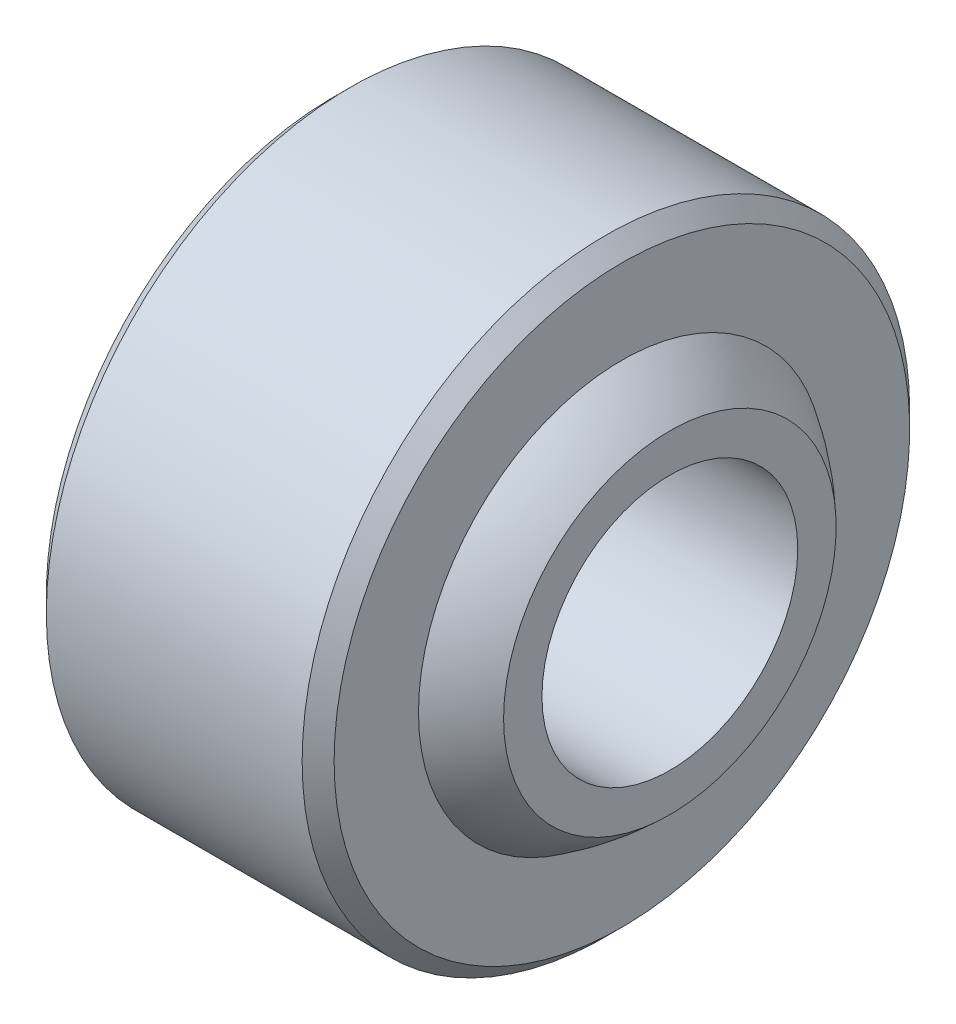
ISO-10303-21;
HEADER;
FILE_DESCRIPTION(('STEP AP214'),'2;1');
FILE_NAME('part.step','',(''),(''),'','','');
FILE_SCHEMA(('AUTOMOTIVE_DESIGN { 1 0 10303 214 1 1 1 1 }'));
ENDSEC;
DATA;
#1=APPLICATION_CONTEXT('core data for automotive mechanical design processes');
#2=APPLICATION_PROTOCOL_DEFINITION('international standard','automotive_design',2000,#1);
#3=PRODUCT_CONTEXT('',#1,'mechanical');
#4=PRODUCT('Part','Part','',(#3));
#5=PRODUCT_RELATED_PRODUCT_CATEGORY('part','',(#4));
#6=PRODUCT_DEFINITION_FORMATION('','',#4);
#7=PRODUCT_DEFINITION_CONTEXT('part definition',#1,'design');
#8=PRODUCT_DEFINITION('design','',#6,#7);
#9=PRODUCT_DEFINITION_SHAPE('','',#8);
#10=(LENGTH_UNIT() NAMED_UNIT(*) SI_UNIT(.MILLI.,.METRE.));
#11=(NAMED_UNIT(*) PLANE_ANGLE_UNIT() SI_UNIT($,.RADIAN.));
#12=(NAMED_UNIT(*) SI_UNIT($,.STERADIAN.) SOLID_ANGLE_UNIT());
#13=UNCERTAINTY_MEASURE_WITH_UNIT(LENGTH_MEASURE(1.E-05),#10,'distance_accuracy_value','');
#14=(GEOMETRIC_REPRESENTATION_CONTEXT(3) GLOBAL_UNCERTAINTY_ASSIGNED_CONTEXT((#13)) GLOBAL_UNIT_ASSIGNED_CONTEXT((#10,
#11,#12)) REPRESENTATION_CONTEXT('',''));
#15=CARTESIAN_POINT('',(0.,0.,0.));
#16=DIRECTION('',(0.,0.,1.));
#17=DIRECTION('',(1.,0.,0.));
#18=AXIS2_PLACEMENT_3D('',#15,#16,#17);
#19=CARTESIAN_POINT('',(-6.,0.,0.));
#20=DIRECTION('',(1.,0.,0.));
#21=DIRECTION('',(0.,0.,-1.));
#22=AXIS2_PLACEMENT_3D('',#19,#20,#21);
#23=PLANE('',#22);
#24=CARTESIAN_POINT('',(-6.,-4.,0.));
#25=DIRECTION('',(-1.,0.,0.));
#26=DIRECTION('',(0.,0.,1.));
#27=AXIS2_PLACEMENT_3D('',#24,#25,#26);
#28=CIRCLE('',#27,4.);
#29=CARTESIAN_POINT('',(-6.,-4.,4.));
#30=VERTEX_POINT('',#29);
#31=EDGE_CURVE('E53',#30,#30,#28,.T.);
#32=ORIENTED_EDGE('',*,*,#31,.F.);
#33=EDGE_LOOP('',(#32));
#34=FACE_BOUND('',#33,.T.);
#35=CARTESIAN_POINT('',(-6.,-4.,0.));
#36=DIRECTION('',(-1.,0.,0.));
#37=DIRECTION('',(0.,0.,1.));
#38=AXIS2_PLACEMENT_3D('',#35,#36,#37);
#39=CIRCLE('',#38,5.2);
#40=CARTESIAN_POINT('',(-6.,-4.,5.2));
#41=VERTEX_POINT('',#40);
#42=EDGE_CURVE('E68',#41,#41,#39,.T.);
#43=ORIENTED_EDGE('',*,*,#42,.T.);
#44=EDGE_LOOP('',(#43));
#45=FACE_BOUND('',#44,.T.);
#46=ADVANCED_FACE('F33',(#34,#45),#23,.F.);
#47=CARTESIAN_POINT('',(-11.2613239882125,-4.,0.));
#48=DIRECTION('',(-1.,0.,0.));
#49=DIRECTION('',(0.,0.,1.));
#50=AXIS2_PLACEMENT_3D('',#47,#48,#49);
#51=CYLINDRICAL_SURFACE('',#50,4.);
#52=CARTESIAN_POINT('',(6.,-4.,0.));
#53=DIRECTION('',(-1.,0.,0.));
#54=DIRECTION('',(0.,0.,1.));
#55=AXIS2_PLACEMENT_3D('',#52,#53,#54);
#56=CIRCLE('',#55,4.);
#57=CARTESIAN_POINT('',(6.,-4.,4.));
#58=VERTEX_POINT('',#57);
#59=EDGE_CURVE('E56',#58,#58,#56,.T.);
#60=ORIENTED_EDGE('',*,*,#59,.F.);
#61=EDGE_LOOP('',(#60));
#62=FACE_BOUND('',#61,.T.);
#63=ORIENTED_EDGE('',*,*,#31,.T.);
#64=EDGE_LOOP('',(#63));
#65=FACE_BOUND('',#64,.T.);
#66=ADVANCED_FACE('F91',(#62,#65),#51,.F.);
#67=CARTESIAN_POINT('',(6.,0.,0.));
#68=DIRECTION('',(-1.,0.,0.));
#69=DIRECTION('',(0.,0.,1.));
#70=AXIS2_PLACEMENT_3D('',#67,#68,#69);
#71=PLANE('',#70);
#72=CARTESIAN_POINT('',(6.,-4.,0.));
#73=DIRECTION('',(-1.,0.,0.));
#74=DIRECTION('',(0.,0.,1.));
#75=AXIS2_PLACEMENT_3D('',#72,#73,#74);
#76=CIRCLE('',#75,5.2);
#77=CARTESIAN_POINT('',(6.,-4.,5.2));
#78=VERTEX_POINT('',#77);
#79=EDGE_CURVE('E59',#78,#78,#76,.T.);
#80=ORIENTED_EDGE('',*,*,#79,.F.);
#81=EDGE_LOOP('',(#80));
#82=FACE_BOUND('',#81,.T.);
#83=ORIENTED_EDGE('',*,*,#59,.T.);
#84=EDGE_LOOP('',(#83));
#85=FACE_BOUND('',#84,.T.);
#86=ADVANCED_FACE('F97',(#82,#85),#71,.F.);
#87=CARTESIAN_POINT('',(0.,-4.,0.));
#88=DIRECTION('',(-1.,0.,0.));
#89=DIRECTION('',(0.,0.,1.));
#90=AXIS2_PLACEMENT_3D('',#87,#88,#89);
#91=DEGENERATE_TOROIDAL_SURFACE('',#90,1.,8.6278618440492,.F.);
#92=CARTESIAN_POINT('',(4.5,-4.,0.));
#93=DIRECTION('',(-1.,0.,0.));
#94=DIRECTION('',(0.,0.,1.));
#95=AXIS2_PLACEMENT_3D('',#92,#93,#94);
#96=CIRCLE('',#95,6.3613857391119);
#97=CARTESIAN_POINT('',(4.5,-4.,6.3613857391119));
#98=VERTEX_POINT('',#97);
#99=EDGE_CURVE('E62',#98,#98,#96,.T.);
#100=ORIENTED_EDGE('',*,*,#99,.F.);
#101=EDGE_LOOP('',(#100));
#102=FACE_BOUND('',#101,.T.);
#103=ORIENTED_EDGE('',*,*,#79,.T.);
#104=EDGE_LOOP('',(#103));
#105=FACE_BOUND('',#104,.T.);
#106=ADVANCED_FACE('F139',(#102,#105),#91,.F.);
#107=CARTESIAN_POINT('',(4.5,5.5,0.));
#108=DIRECTION('',(-1.,0.,0.));
#109=DIRECTION('',(0.,0.,1.));
#110=AXIS2_PLACEMENT_3D('',#107,#108,#109);
#111=PLANE('',#110);
#112=CARTESIAN_POINT('',(4.5,-4.,0.));
#113=DIRECTION('',(-1.,0.,0.));
#114=DIRECTION('',(0.,0.,1.));
#115=AXIS2_PLACEMENT_3D('',#112,#113,#114);
#116=CIRCLE('',#115,9.);
#117=CARTESIAN_POINT('',(4.5,-4.,9.));
#118=VERTEX_POINT('',#117);
#119=EDGE_CURVE('E10',#118,#118,#116,.F.);
#120=ORIENTED_EDGE('',*,*,#119,.T.);
#121=EDGE_LOOP('',(#120));
#122=FACE_BOUND('',#121,.T.);
#123=ORIENTED_EDGE('',*,*,#99,.T.);
#124=EDGE_LOOP('',(#123));
#125=FACE_BOUND('',#124,.T.);
#126=ADVANCED_FACE('F88',(#122,#125),#111,.F.);
#127=CARTESIAN_POINT('',(-11.2613239882125,-4.,0.));
#128=DIRECTION('',(-1.,0.,0.));
#129=DIRECTION('',(0.,0.,1.));
#130=AXIS2_PLACEMENT_3D('',#127,#128,#129);
#131=CYLINDRICAL_SURFACE('',#130,9.5);
#132=CARTESIAN_POINT('',(-4.,-4.,0.));
#133=DIRECTION('',(1.,0.,0.));
#134=DIRECTION('',(0.,0.,-1.));
#135=AXIS2_PLACEMENT_3D('',#132,#133,#134);
#136=CIRCLE('',#135,9.5);
#137=CARTESIAN_POINT('',(-4.,-4.,-9.5));
#138=VERTEX_POINT('',#137);
#139=EDGE_CURVE('E40',#138,#138,#136,.T.);
#140=ORIENTED_EDGE('',*,*,#139,.T.);
#141=EDGE_LOOP('',(#140));
#142=FACE_BOUND('',#141,.T.);
#143=CARTESIAN_POINT('',(4.,-4.,0.));
#144=DIRECTION('',(-1.,0.,0.));
#145=DIRECTION('',(0.,0.,1.));
#146=AXIS2_PLACEMENT_3D('',#143,#144,#145);
#147=CIRCLE('',#146,9.5);
#148=CARTESIAN_POINT('',(4.,-4.,9.5));
#149=VERTEX_POINT('',#148);
#150=EDGE_CURVE('E44',#149,#149,#147,.T.);
#151=ORIENTED_EDGE('',*,*,#150,.T.);
#152=EDGE_LOOP('',(#151));
#153=FACE_BOUND('',#152,.T.);
#154=ADVANCED_FACE('F82',(#142,#153),#131,.T.);
#155=CARTESIAN_POINT('',(-4.5,5.5,0.));
#156=DIRECTION('',(1.,0.,0.));
#157=DIRECTION('',(0.,0.,-1.));
#158=AXIS2_PLACEMENT_3D('',#155,#156,#157);
#159=PLANE('',#158);
#160=CARTESIAN_POINT('',(-4.5,-4.,0.));
#161=DIRECTION('',(1.,0.,0.));
#162=DIRECTION('',(0.,0.,-1.));
#163=AXIS2_PLACEMENT_3D('',#160,#161,#162);
#164=CIRCLE('',#163,9.00000000000001);
#165=CARTESIAN_POINT('',(-4.5,-4.,-9.00000000000001));
#166=VERTEX_POINT('',#165);
#167=EDGE_CURVE('E48',#166,#166,#164,.F.);
#168=ORIENTED_EDGE('',*,*,#167,.T.);
#169=EDGE_LOOP('',(#168));
#170=FACE_BOUND('',#169,.T.);
#171=CARTESIAN_POINT('',(-4.5,-4.,0.));
#172=DIRECTION('',(-1.,0.,0.));
#173=DIRECTION('',(0.,0.,1.));
#174=AXIS2_PLACEMENT_3D('',#171,#172,#173);
#175=CIRCLE('',#174,6.3613857391119);
#176=CARTESIAN_POINT('',(-4.5,-4.,6.3613857391119));
#177=VERTEX_POINT('',#176);
#178=EDGE_CURVE('E65',#177,#177,#175,.T.);
#179=ORIENTED_EDGE('',*,*,#178,.F.);
#180=EDGE_LOOP('',(#179));
#181=FACE_BOUND('',#180,.T.);
#182=ADVANCED_FACE('F77',(#170,#181),#159,.F.);
#183=CARTESIAN_POINT('',(0.,-4.,0.));
#184=DIRECTION('',(-1.,0.,0.));
#185=DIRECTION('',(0.,0.,1.));
#186=AXIS2_PLACEMENT_3D('',#183,#184,#185);
#187=DEGENERATE_TOROIDAL_SURFACE('',#186,1.,8.6278618440492,.F.);
#188=ORIENTED_EDGE('',*,*,#42,.F.);
#189=EDGE_LOOP('',(#188));
#190=FACE_BOUND('',#189,.T.);
#191=ORIENTED_EDGE('',*,*,#178,.T.);
#192=EDGE_LOOP('',(#191));
#193=FACE_BOUND('',#192,.T.);
#194=ADVANCED_FACE('F73',(#190,#193),#187,.F.);
#195=CARTESIAN_POINT('',(-4.5,-4.,0.));
#196=DIRECTION('',(1.,0.,0.));
#197=DIRECTION('',(0.,0.,-1.));
#198=AXIS2_PLACEMENT_3D('',#195,#196,#197);
#199=CONICAL_SURFACE('',#198,9.00000000000001,0.785398163397447);
#200=ORIENTED_EDGE('',*,*,#139,.F.);
#201=EDGE_LOOP('',(#200));
#202=FACE_BOUND('',#201,.T.);
#203=ORIENTED_EDGE('',*,*,#167,.F.);
#204=EDGE_LOOP('',(#203));
#205=FACE_BOUND('',#204,.T.);
#206=ADVANCED_FACE('F76',(#202,#205),#199,.T.);
#207=CARTESIAN_POINT('',(4.,-4.,0.));
#208=DIRECTION('',(-1.,0.,0.));
#209=DIRECTION('',(0.,0.,1.));
#210=AXIS2_PLACEMENT_3D('',#207,#208,#209);
#211=CONICAL_SURFACE('',#210,9.5,0.78539816339745);
#212=ORIENTED_EDGE('',*,*,#119,.F.);
#213=EDGE_LOOP('',(#212));
#214=FACE_BOUND('',#213,.T.);
#215=ORIENTED_EDGE('',*,*,#150,.F.);
#216=EDGE_LOOP('',(#215));
#217=FACE_BOUND('',#216,.T.);
#218=ADVANCED_FACE('F35',(#214,#217),#211,.T.);
#219=CLOSED_SHELL('',(#46,#66,#86,#106,#126,#154,#182,#194,#206,#218));
#220=MANIFOLD_SOLID_BREP('B2',#219);
#221=ADVANCED_BREP_SHAPE_REPRESENTATION('',(#18,#220),#14);
#222=SHAPE_DEFINITION_REPRESENTATION(#9,#221);
ENDSEC;
END-ISO-10303-21;
